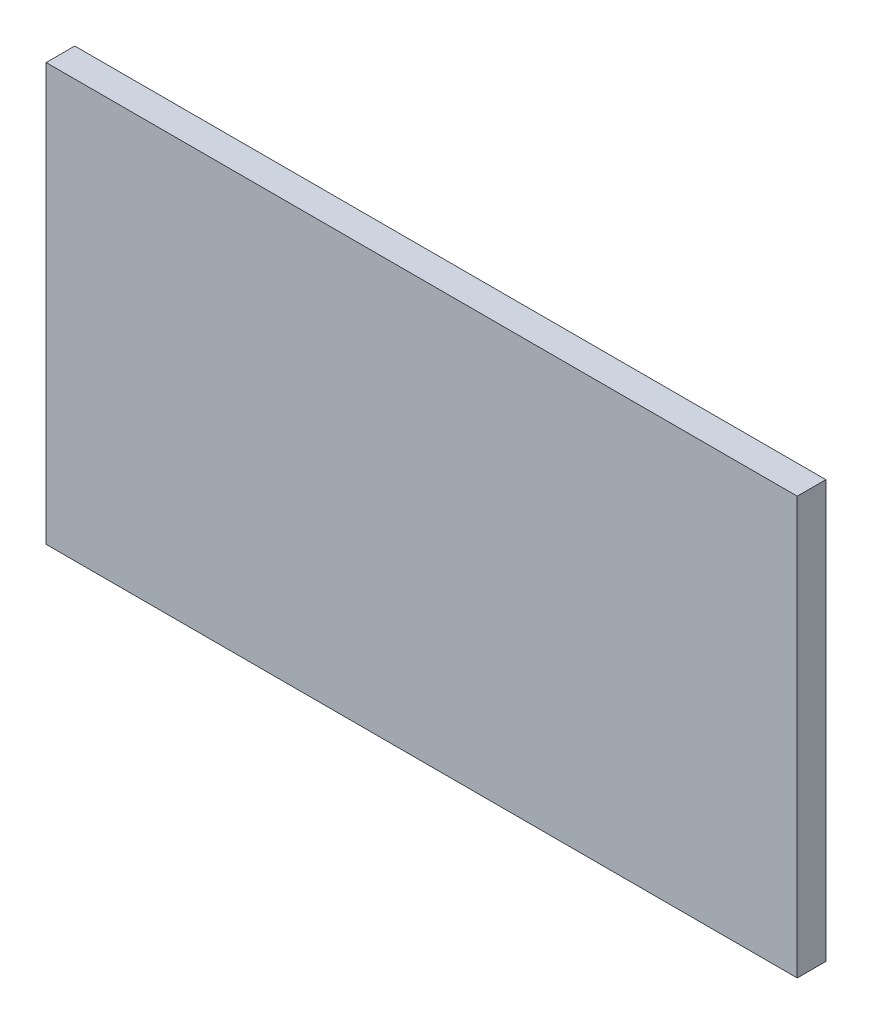
ISO-10303-21;
HEADER;
FILE_DESCRIPTION(('STEP AP214'),'2;1');
FILE_NAME('part.step','',(''),(''),'','','');
FILE_SCHEMA(('AUTOMOTIVE_DESIGN { 1 0 10303 214 1 1 1 1 }'));
ENDSEC;
DATA;
#1=APPLICATION_CONTEXT('core data for automotive mechanical design processes');
#2=APPLICATION_PROTOCOL_DEFINITION('international standard','automotive_design',2000,#1);
#3=PRODUCT_CONTEXT('',#1,'mechanical');
#4=PRODUCT('Part','Part','',(#3));
#5=PRODUCT_RELATED_PRODUCT_CATEGORY('part','',(#4));
#6=PRODUCT_DEFINITION_FORMATION('','',#4);
#7=PRODUCT_DEFINITION_CONTEXT('part definition',#1,'design');
#8=PRODUCT_DEFINITION('design','',#6,#7);
#9=PRODUCT_DEFINITION_SHAPE('','',#8);
#10=(LENGTH_UNIT() NAMED_UNIT(*) SI_UNIT(.MILLI.,.METRE.));
#11=(NAMED_UNIT(*) PLANE_ANGLE_UNIT() SI_UNIT($,.RADIAN.));
#12=(NAMED_UNIT(*) SI_UNIT($,.STERADIAN.) SOLID_ANGLE_UNIT());
#13=UNCERTAINTY_MEASURE_WITH_UNIT(LENGTH_MEASURE(1.E-05),#10,'distance_accuracy_value','');
#14=(GEOMETRIC_REPRESENTATION_CONTEXT(3) GLOBAL_UNCERTAINTY_ASSIGNED_CONTEXT((#13)) GLOBAL_UNIT_ASSIGNED_CONTEXT((#10,
#11,#12)) REPRESENTATION_CONTEXT('',''));
#15=CARTESIAN_POINT('',(0.,0.,0.));
#16=DIRECTION('',(0.,0.,1.));
#17=DIRECTION('',(1.,0.,0.));
#18=AXIS2_PLACEMENT_3D('',#15,#16,#17);
#19=CARTESIAN_POINT('',(12.50008,7.2,0.));
#20=DIRECTION('',(0.,0.,-1.));
#21=DIRECTION('',(-1.,0.,0.));
#22=AXIS2_PLACEMENT_3D('',#19,#20,#21);
#23=PLANE('',#22);
#24=DIRECTION('',(1.,0.,0.));
#25=VECTOR('',#24,1.);
#26=CARTESIAN_POINT('',(12.05008,7.45,0.));
#27=LINE('',#26,#25);
#28=CARTESIAN_POINT('',(12.05008,7.45,0.));
#29=VERTEX_POINT('',#28);
#30=CARTESIAN_POINT('',(12.95008,7.45,0.));
#31=VERTEX_POINT('',#30);
#32=EDGE_CURVE('E55',#29,#31,#27,.T.);
#33=ORIENTED_EDGE('',*,*,#32,.T.);
#34=DIRECTION('',(0.,1.,0.));
#35=VECTOR('',#34,1.);
#36=CARTESIAN_POINT('',(12.95008,7.45,0.));
#37=LINE('',#36,#35);
#38=CARTESIAN_POINT('',(12.95008,6.95,0.));
#39=VERTEX_POINT('',#38);
#40=EDGE_CURVE('E57',#31,#39,#37,.F.);
#41=ORIENTED_EDGE('',*,*,#40,.T.);
#42=DIRECTION('',(1.,0.,0.));
#43=VECTOR('',#42,1.);
#44=CARTESIAN_POINT('',(12.95008,6.95,0.));
#45=LINE('',#44,#43);
#46=CARTESIAN_POINT('',(12.05008,6.95,0.));
#47=VERTEX_POINT('',#46);
#48=EDGE_CURVE('E20',#39,#47,#45,.F.);
#49=ORIENTED_EDGE('',*,*,#48,.T.);
#50=DIRECTION('',(0.,1.,0.));
#51=VECTOR('',#50,1.);
#52=CARTESIAN_POINT('',(12.05008,6.95,0.));
#53=LINE('',#52,#51);
#54=EDGE_CURVE('E80',#47,#29,#53,.T.);
#55=ORIENTED_EDGE('',*,*,#54,.T.);
#56=EDGE_LOOP('',(#33,#41,#49,#55));
#57=FACE_BOUND('',#56,.T.);
#58=ADVANCED_FACE('F17',(#57),#23,.T.);
#59=CARTESIAN_POINT('',(12.95008,6.95,0.));
#60=DIRECTION('',(0.,1.,0.));
#61=DIRECTION('',(0.,0.,1.));
#62=AXIS2_PLACEMENT_3D('',#59,#60,#61);
#63=PLANE('',#62);
#64=DIRECTION('',(0.,0.,-1.));
#65=VECTOR('',#64,1.);
#66=CARTESIAN_POINT('',(12.05008,6.95,0.));
#67=LINE('',#66,#65);
#68=CARTESIAN_POINT('',(12.05008,6.95,0.03429));
#69=VERTEX_POINT('',#68);
#70=EDGE_CURVE('E68',#69,#47,#67,.T.);
#71=ORIENTED_EDGE('',*,*,#70,.T.);
#72=ORIENTED_EDGE('',*,*,#48,.F.);
#73=DIRECTION('',(0.,0.,1.));
#74=VECTOR('',#73,1.);
#75=CARTESIAN_POINT('',(12.95008,6.95,0.));
#76=LINE('',#75,#74);
#77=CARTESIAN_POINT('',(12.95008,6.95,0.03429));
#78=VERTEX_POINT('',#77);
#79=EDGE_CURVE('E63',#39,#78,#76,.T.);
#80=ORIENTED_EDGE('',*,*,#79,.T.);
#81=DIRECTION('',(1.,0.,0.));
#82=VECTOR('',#81,1.);
#83=CARTESIAN_POINT('',(12.50008,6.95,0.03429));
#84=LINE('',#83,#82);
#85=EDGE_CURVE('E83',#69,#78,#84,.T.);
#86=ORIENTED_EDGE('',*,*,#85,.F.);
#87=EDGE_LOOP('',(#71,#72,#80,#86));
#88=FACE_BOUND('',#87,.T.);
#89=ADVANCED_FACE('F65',(#88),#63,.F.);
#90=CARTESIAN_POINT('',(12.95008,7.45,0.));
#91=DIRECTION('',(-1.,0.,0.));
#92=DIRECTION('',(0.,0.,1.));
#93=AXIS2_PLACEMENT_3D('',#90,#91,#92);
#94=PLANE('',#93);
#95=ORIENTED_EDGE('',*,*,#79,.F.);
#96=ORIENTED_EDGE('',*,*,#40,.F.);
#97=DIRECTION('',(0.,0.,-1.));
#98=VECTOR('',#97,1.);
#99=CARTESIAN_POINT('',(12.95008,7.45,0.));
#100=LINE('',#99,#98);
#101=CARTESIAN_POINT('',(12.95008,7.45,0.03429));
#102=VERTEX_POINT('',#101);
#103=EDGE_CURVE('E75',#31,#102,#100,.F.);
#104=ORIENTED_EDGE('',*,*,#103,.T.);
#105=DIRECTION('',(0.,1.,0.));
#106=VECTOR('',#105,1.);
#107=CARTESIAN_POINT('',(12.95008,7.2,0.03429));
#108=LINE('',#107,#106);
#109=EDGE_CURVE('E72',#78,#102,#108,.T.);
#110=ORIENTED_EDGE('',*,*,#109,.F.);
#111=EDGE_LOOP('',(#95,#96,#104,#110));
#112=FACE_BOUND('',#111,.T.);
#113=ADVANCED_FACE('F70',(#112),#94,.F.);
#114=CARTESIAN_POINT('',(12.05008,7.45,0.));
#115=DIRECTION('',(0.,-1.,0.));
#116=DIRECTION('',(0.,0.,-1.));
#117=AXIS2_PLACEMENT_3D('',#114,#115,#116);
#118=PLANE('',#117);
#119=ORIENTED_EDGE('',*,*,#103,.F.);
#120=ORIENTED_EDGE('',*,*,#32,.F.);
#121=DIRECTION('',(0.,0.,-1.));
#122=VECTOR('',#121,1.);
#123=CARTESIAN_POINT('',(12.05008,7.45,0.));
#124=LINE('',#123,#122);
#125=CARTESIAN_POINT('',(12.05008,7.45,0.03429));
#126=VERTEX_POINT('',#125);
#127=EDGE_CURVE('E35',#29,#126,#124,.F.);
#128=ORIENTED_EDGE('',*,*,#127,.T.);
#129=DIRECTION('',(1.,0.,0.));
#130=VECTOR('',#129,1.);
#131=CARTESIAN_POINT('',(12.50008,7.45,0.03429));
#132=LINE('',#131,#130);
#133=EDGE_CURVE('E26',#102,#126,#132,.F.);
#134=ORIENTED_EDGE('',*,*,#133,.F.);
#135=EDGE_LOOP('',(#119,#120,#128,#134));
#136=FACE_BOUND('',#135,.T.);
#137=ADVANCED_FACE('F89',(#136),#118,.F.);
#138=CARTESIAN_POINT('',(12.05008,6.95,0.));
#139=DIRECTION('',(1.,0.,0.));
#140=DIRECTION('',(0.,0.,-1.));
#141=AXIS2_PLACEMENT_3D('',#138,#139,#140);
#142=PLANE('',#141);
#143=ORIENTED_EDGE('',*,*,#127,.F.);
#144=ORIENTED_EDGE('',*,*,#54,.F.);
#145=ORIENTED_EDGE('',*,*,#70,.F.);
#146=DIRECTION('',(0.,1.,0.));
#147=VECTOR('',#146,1.);
#148=CARTESIAN_POINT('',(12.05008,7.2,0.03429));
#149=LINE('',#148,#147);
#150=EDGE_CURVE('E11',#126,#69,#149,.F.);
#151=ORIENTED_EDGE('',*,*,#150,.F.);
#152=EDGE_LOOP('',(#143,#144,#145,#151));
#153=FACE_BOUND('',#152,.T.);
#154=ADVANCED_FACE('F91',(#153),#142,.F.);
#155=CARTESIAN_POINT('',(12.50008,7.2,0.03429));
#156=DIRECTION('',(0.,0.,1.));
#157=DIRECTION('',(1.,0.,0.));
#158=AXIS2_PLACEMENT_3D('',#155,#156,#157);
#159=PLANE('',#158);
#160=ORIENTED_EDGE('',*,*,#133,.T.);
#161=ORIENTED_EDGE('',*,*,#150,.T.);
#162=ORIENTED_EDGE('',*,*,#85,.T.);
#163=ORIENTED_EDGE('',*,*,#109,.T.);
#164=EDGE_LOOP('',(#160,#161,#162,#163));
#165=FACE_BOUND('',#164,.T.);
#166=ADVANCED_FACE('F88',(#165),#159,.T.);
#167=CLOSED_SHELL('',(#58,#89,#113,#137,#154,#166));
#168=MANIFOLD_SOLID_BREP('B1',#167);
#169=ADVANCED_BREP_SHAPE_REPRESENTATION('',(#18,#168),#14);
#170=SHAPE_DEFINITION_REPRESENTATION(#9,#169);
ENDSEC;
END-ISO-10303-21;
